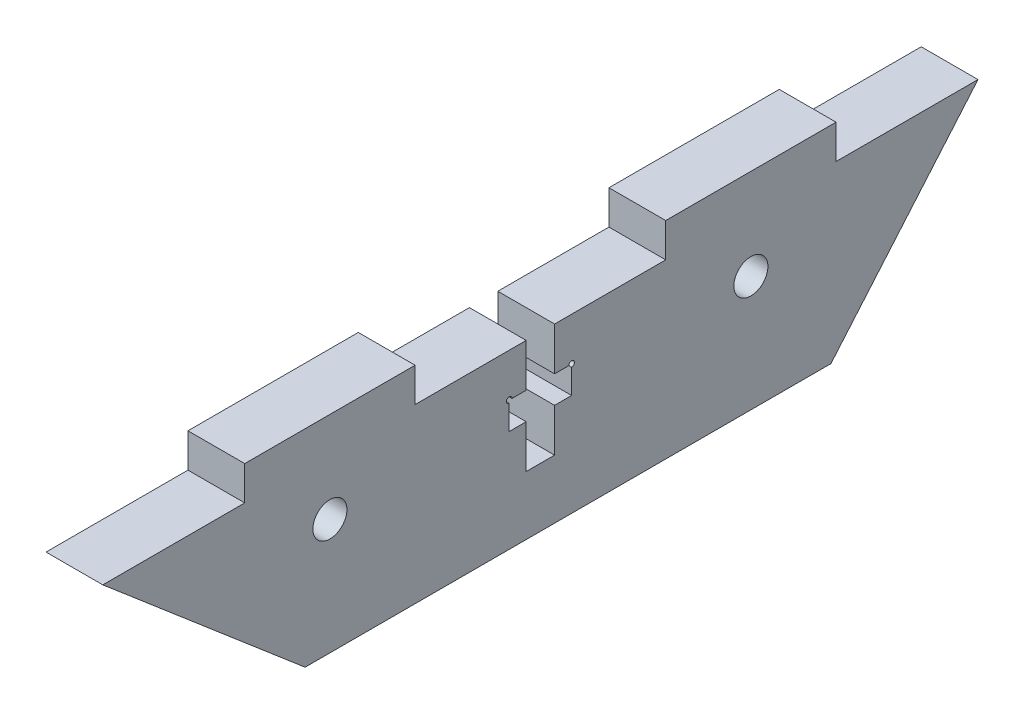
ISO-10303-21;
HEADER;
FILE_DESCRIPTION(('STEP AP214'),'2;1');
FILE_NAME('part.step','',(''),(''),'','','');
FILE_SCHEMA(('AUTOMOTIVE_DESIGN { 1 0 10303 214 1 1 1 1 }'));
ENDSEC;
DATA;
#1=APPLICATION_CONTEXT('core data for automotive mechanical design processes');
#2=APPLICATION_PROTOCOL_DEFINITION('international standard','automotive_design',2000,#1);
#3=PRODUCT_CONTEXT('',#1,'mechanical');
#4=PRODUCT('Part','Part','',(#3));
#5=PRODUCT_RELATED_PRODUCT_CATEGORY('part','',(#4));
#6=PRODUCT_DEFINITION_FORMATION('','',#4);
#7=PRODUCT_DEFINITION_CONTEXT('part definition',#1,'design');
#8=PRODUCT_DEFINITION('design','',#6,#7);
#9=PRODUCT_DEFINITION_SHAPE('','',#8);
#10=(LENGTH_UNIT() NAMED_UNIT(*) SI_UNIT(.MILLI.,.METRE.));
#11=(NAMED_UNIT(*) PLANE_ANGLE_UNIT() SI_UNIT($,.RADIAN.));
#12=(NAMED_UNIT(*) SI_UNIT($,.STERADIAN.) SOLID_ANGLE_UNIT());
#13=UNCERTAINTY_MEASURE_WITH_UNIT(LENGTH_MEASURE(1.E-05),#10,'distance_accuracy_value','');
#14=(GEOMETRIC_REPRESENTATION_CONTEXT(3) GLOBAL_UNCERTAINTY_ASSIGNED_CONTEXT((#13)) GLOBAL_UNIT_ASSIGNED_CONTEXT((#10,
#11,#12)) REPRESENTATION_CONTEXT('',''));
#15=CARTESIAN_POINT('',(0.,0.,0.));
#16=DIRECTION('',(0.,0.,1.));
#17=DIRECTION('',(1.,0.,0.));
#18=AXIS2_PLACEMENT_3D('',#15,#16,#17);
#19=CARTESIAN_POINT('',(5.,7.595,38.535));
#20=DIRECTION('',(0.,-1.,0.));
#21=DIRECTION('',(0.,0.,-1.));
#22=AXIS2_PLACEMENT_3D('',#19,#20,#21);
#23=PLANE('',#22);
#24=DIRECTION('',(-1.,0.,0.));
#25=VECTOR('',#24,1.);
#26=CARTESIAN_POINT('',(5.00005,7.595,-1.24999999999999));
#27=LINE('',#26,#25);
#28=CARTESIAN_POINT('',(5.,7.595,-1.24999999999999));
#29=VERTEX_POINT('',#28);
#30=CARTESIAN_POINT('',(0.,7.595,-1.24999999999999));
#31=VERTEX_POINT('',#30);
#32=EDGE_CURVE('E363',#29,#31,#27,.T.);
#33=ORIENTED_EDGE('',*,*,#32,.F.);
#34=DIRECTION('',(0.,0.,1.));
#35=VECTOR('',#34,1.);
#36=CARTESIAN_POINT('',(5.,7.595,38.535));
#37=LINE('',#36,#35);
#38=CARTESIAN_POINT('',(5.,7.595,-11.035));
#39=VERTEX_POINT('',#38);
#40=EDGE_CURVE('E287',#39,#29,#37,.T.);
#41=ORIENTED_EDGE('',*,*,#40,.F.);
#42=DIRECTION('',(1.,0.,0.));
#43=VECTOR('',#42,1.);
#44=CARTESIAN_POINT('',(0.,7.595,-11.035));
#45=LINE('',#44,#43);
#46=CARTESIAN_POINT('',(0.,7.595,-11.035));
#47=VERTEX_POINT('',#46);
#48=EDGE_CURVE('E267',#47,#39,#45,.T.);
#49=ORIENTED_EDGE('',*,*,#48,.F.);
#50=DIRECTION('',(0.,0.,1.));
#51=VECTOR('',#50,1.);
#52=CARTESIAN_POINT('',(0.,7.595,38.535));
#53=LINE('',#52,#51);
#54=EDGE_CURVE('E327',#47,#31,#53,.T.);
#55=ORIENTED_EDGE('',*,*,#54,.T.);
#56=EDGE_LOOP('',(#33,#41,#49,#55));
#57=FACE_BOUND('',#56,.T.);
#58=ADVANCED_FACE('F35',(#57),#23,.F.);
#59=DIRECTION('',(-1.,0.,0.));
#60=VECTOR('',#59,1.);
#61=CARTESIAN_POINT('',(5.00005,7.595,1.24999999999999));
#62=LINE('',#61,#60);
#63=CARTESIAN_POINT('',(5.,7.595,1.24999999999999));
#64=VERTEX_POINT('',#63);
#65=CARTESIAN_POINT('',(0.,7.595,1.24999999999999));
#66=VERTEX_POINT('',#65);
#67=EDGE_CURVE('E404',#64,#66,#62,.T.);
#68=ORIENTED_EDGE('',*,*,#67,.T.);
#69=CARTESIAN_POINT('',(0.,7.595,11.035));
#70=VERTEX_POINT('',#69);
#71=EDGE_CURVE('E315',#66,#70,#53,.T.);
#72=ORIENTED_EDGE('',*,*,#71,.T.);
#73=DIRECTION('',(-1.,0.,0.));
#74=VECTOR('',#73,1.);
#75=CARTESIAN_POINT('',(0.,7.595,11.035));
#76=LINE('',#75,#74);
#77=CARTESIAN_POINT('',(5.,7.595,11.035));
#78=VERTEX_POINT('',#77);
#79=EDGE_CURVE('E245',#78,#70,#76,.T.);
#80=ORIENTED_EDGE('',*,*,#79,.F.);
#81=EDGE_CURVE('E347',#64,#78,#37,.T.);
#82=ORIENTED_EDGE('',*,*,#81,.F.);
#83=EDGE_LOOP('',(#68,#72,#80,#82));
#84=FACE_BOUND('',#83,.T.);
#85=ADVANCED_FACE('F392',(#84),#23,.F.);
#86=CARTESIAN_POINT('',(5.,0.,0.));
#87=DIRECTION('',(1.,0.,0.));
#88=DIRECTION('',(0.,0.,-1.));
#89=AXIS2_PLACEMENT_3D('',#86,#87,#88);
#90=PLANE('',#89);
#91=CARTESIAN_POINT('',(5.,3.79500000000001,-2.75));
#92=DIRECTION('',(1.,0.,0.));
#93=DIRECTION('',(0.,0.,-1.));
#94=AXIS2_PLACEMENT_3D('',#91,#92,#93);
#95=CIRCLE('',#94,0.25);
#96=CARTESIAN_POINT('',(5.,3.54500000000001,-2.75));
#97=VERTEX_POINT('',#96);
#98=CARTESIAN_POINT('',(5.,3.79500000000001,-2.5));
#99=VERTEX_POINT('',#98);
#100=EDGE_CURVE('E49',#97,#99,#95,.T.);
#101=ORIENTED_EDGE('',*,*,#100,.F.);
#102=DIRECTION('',(0.,-1.,0.));
#103=VECTOR('',#102,1.);
#104=CARTESIAN_POINT('',(5.,0.,-2.75));
#105=LINE('',#104,#103);
#106=CARTESIAN_POINT('',(5.,1.39500000000001,-2.75));
#107=VERTEX_POINT('',#106);
#108=EDGE_CURVE('E219',#97,#107,#105,.T.);
#109=ORIENTED_EDGE('',*,*,#108,.T.);
#110=DIRECTION('',(0.,0.,1.));
#111=VECTOR('',#110,1.);
#112=CARTESIAN_POINT('',(5.,1.395,0.));
#113=LINE('',#112,#111);
#114=CARTESIAN_POINT('',(5.,1.395,-1.24999999999999));
#115=VERTEX_POINT('',#114);
#116=EDGE_CURVE('E227',#107,#115,#113,.T.);
#117=ORIENTED_EDGE('',*,*,#116,.T.);
#118=DIRECTION('',(0.,-1.,0.));
#119=VECTOR('',#118,1.);
#120=CARTESIAN_POINT('',(5.,0.,-1.24999999999999));
#121=LINE('',#120,#119);
#122=CARTESIAN_POINT('',(5.,-2.405,-1.24999999999999));
#123=VERTEX_POINT('',#122);
#124=EDGE_CURVE('E229',#115,#123,#121,.T.);
#125=ORIENTED_EDGE('',*,*,#124,.T.);
#126=DIRECTION('',(0.,0.,1.));
#127=VECTOR('',#126,1.);
#128=CARTESIAN_POINT('',(5.,-2.405,0.));
#129=LINE('',#128,#127);
#130=CARTESIAN_POINT('',(5.,-2.405,1.24999999999999));
#131=VERTEX_POINT('',#130);
#132=EDGE_CURVE('E237',#123,#131,#129,.T.);
#133=ORIENTED_EDGE('',*,*,#132,.T.);
#134=DIRECTION('',(0.,1.,0.));
#135=VECTOR('',#134,1.);
#136=CARTESIAN_POINT('',(5.,0.,1.24999999999999));
#137=LINE('',#136,#135);
#138=CARTESIAN_POINT('',(5.,1.395,1.24999999999999));
#139=VERTEX_POINT('',#138);
#140=EDGE_CURVE('E433',#131,#139,#137,.T.);
#141=ORIENTED_EDGE('',*,*,#140,.T.);
#142=DIRECTION('',(0.,0.,1.));
#143=VECTOR('',#142,1.);
#144=CARTESIAN_POINT('',(5.,1.395,0.));
#145=LINE('',#144,#143);
#146=CARTESIAN_POINT('',(5.,1.39499999999999,2.75));
#147=VERTEX_POINT('',#146);
#148=EDGE_CURVE('E430',#139,#147,#145,.T.);
#149=ORIENTED_EDGE('',*,*,#148,.T.);
#150=DIRECTION('',(0.,1.,0.));
#151=VECTOR('',#150,1.);
#152=CARTESIAN_POINT('',(5.,0.,2.75));
#153=LINE('',#152,#151);
#154=CARTESIAN_POINT('',(5.,3.54499999999999,2.75));
#155=VERTEX_POINT('',#154);
#156=EDGE_CURVE('E425',#147,#155,#153,.T.);
#157=ORIENTED_EDGE('',*,*,#156,.T.);
#158=CARTESIAN_POINT('',(5.,3.79499999999999,2.75));
#159=DIRECTION('',(1.,0.,0.));
#160=DIRECTION('',(0.,0.,-1.));
#161=AXIS2_PLACEMENT_3D('',#158,#159,#160);
#162=CIRCLE('',#161,0.25);
#163=CARTESIAN_POINT('',(5.,3.79499999999999,2.5));
#164=VERTEX_POINT('',#163);
#165=EDGE_CURVE('E57',#164,#155,#162,.T.);
#166=ORIENTED_EDGE('',*,*,#165,.F.);
#167=DIRECTION('',(0.,0.,-1.));
#168=VECTOR('',#167,1.);
#169=CARTESIAN_POINT('',(5.,3.795,0.));
#170=LINE('',#169,#168);
#171=CARTESIAN_POINT('',(5.,3.795,1.24999999999999));
#172=VERTEX_POINT('',#171);
#173=EDGE_CURVE('E422',#164,#172,#170,.T.);
#174=ORIENTED_EDGE('',*,*,#173,.T.);
#175=DIRECTION('',(0.,1.,0.));
#176=VECTOR('',#175,1.);
#177=CARTESIAN_POINT('',(5.,0.,1.24999999999999));
#178=LINE('',#177,#176);
#179=EDGE_CURVE('E420',#172,#64,#178,.T.);
#180=ORIENTED_EDGE('',*,*,#179,.T.);
#181=ORIENTED_EDGE('',*,*,#81,.T.);
#182=DIRECTION('',(0.,-1.,0.));
#183=VECTOR('',#182,1.);
#184=CARTESIAN_POINT('',(5.00000000000003,10.595,11.035));
#185=LINE('',#184,#183);
#186=CARTESIAN_POINT('',(5.00000000000003,10.595,11.035));
#187=VERTEX_POINT('',#186);
#188=EDGE_CURVE('E261',#187,#78,#185,.T.);
#189=ORIENTED_EDGE('',*,*,#188,.F.);
#190=DIRECTION('',(0.,0.,-1.));
#191=VECTOR('',#190,1.);
#192=CARTESIAN_POINT('',(5.00000000000007,10.595,26.035));
#193=LINE('',#192,#191);
#194=CARTESIAN_POINT('',(5.00000000000007,10.595,26.035));
#195=VERTEX_POINT('',#194);
#196=EDGE_CURVE('E244',#195,#187,#193,.T.);
#197=ORIENTED_EDGE('',*,*,#196,.F.);
#198=DIRECTION('',(0.,-1.,0.));
#199=VECTOR('',#198,1.);
#200=CARTESIAN_POINT('',(5.00000000000007,10.595,26.035));
#201=LINE('',#200,#199);
#202=CARTESIAN_POINT('',(5.,7.595,26.035));
#203=VERTEX_POINT('',#202);
#204=EDGE_CURVE('E264',#195,#203,#201,.T.);
#205=ORIENTED_EDGE('',*,*,#204,.T.);
#206=CARTESIAN_POINT('',(5.,7.595,38.535));
#207=VERTEX_POINT('',#206);
#208=EDGE_CURVE('E317',#203,#207,#37,.T.);
#209=ORIENTED_EDGE('',*,*,#208,.T.);
#210=DIRECTION('',(0.,0.648784221735362,0.760972426325186));
#211=VECTOR('',#210,1.);
#212=CARTESIAN_POINT('',(5.,-7.595,20.7183349692734));
#213=LINE('',#212,#211);
#214=CARTESIAN_POINT('',(5.,-7.595,20.7183349692734));
#215=VERTEX_POINT('',#214);
#216=EDGE_CURVE('E567',#215,#207,#213,.T.);
#217=ORIENTED_EDGE('',*,*,#216,.F.);
#218=DIRECTION('',(0.,0.,-1.));
#219=VECTOR('',#218,1.);
#220=CARTESIAN_POINT('',(5.,-7.595,38.535));
#221=LINE('',#220,#219);
#222=CARTESIAN_POINT('',(5.,-7.595,-25.5844225713919));
#223=VERTEX_POINT('',#222);
#224=EDGE_CURVE('E331',#215,#223,#221,.T.);
#225=ORIENTED_EDGE('',*,*,#224,.T.);
#226=DIRECTION('',(0.,-0.760972426325188,0.648784221735359));
#227=VECTOR('',#226,1.);
#228=CARTESIAN_POINT('',(5.,7.595,-38.535));
#229=LINE('',#228,#227);
#230=CARTESIAN_POINT('',(5.,7.595,-38.535));
#231=VERTEX_POINT('',#230);
#232=EDGE_CURVE('E574',#231,#223,#229,.T.);
#233=ORIENTED_EDGE('',*,*,#232,.F.);
#234=CARTESIAN_POINT('',(5.,7.595,-26.035));
#235=VERTEX_POINT('',#234);
#236=EDGE_CURVE('E338',#231,#235,#37,.T.);
#237=ORIENTED_EDGE('',*,*,#236,.T.);
#238=DIRECTION('',(0.,-1.,0.));
#239=VECTOR('',#238,1.);
#240=CARTESIAN_POINT('',(5.,10.595,-26.035));
#241=LINE('',#240,#239);
#242=CARTESIAN_POINT('',(5.,10.595,-26.035));
#243=VERTEX_POINT('',#242);
#244=EDGE_CURVE('E294',#243,#235,#241,.T.);
#245=ORIENTED_EDGE('',*,*,#244,.F.);
#246=DIRECTION('',(0.,0.,-1.));
#247=VECTOR('',#246,1.);
#248=CARTESIAN_POINT('',(5.,10.595,-26.035));
#249=LINE('',#248,#247);
#250=CARTESIAN_POINT('',(5.,10.595,-11.035));
#251=VERTEX_POINT('',#250);
#252=EDGE_CURVE('E274',#251,#243,#249,.T.);
#253=ORIENTED_EDGE('',*,*,#252,.F.);
#254=DIRECTION('',(0.,-1.,0.));
#255=VECTOR('',#254,1.);
#256=CARTESIAN_POINT('',(5.,10.595,-11.035));
#257=LINE('',#256,#255);
#258=EDGE_CURVE('E290',#251,#39,#257,.T.);
#259=ORIENTED_EDGE('',*,*,#258,.T.);
#260=ORIENTED_EDGE('',*,*,#40,.T.);
#261=DIRECTION('',(0.,-1.,0.));
#262=VECTOR('',#261,1.);
#263=CARTESIAN_POINT('',(5.,0.,-1.24999999999999));
#264=LINE('',#263,#262);
#265=CARTESIAN_POINT('',(5.,3.795,-1.24999999999999));
#266=VERTEX_POINT('',#265);
#267=EDGE_CURVE('E231',#29,#266,#264,.T.);
#268=ORIENTED_EDGE('',*,*,#267,.T.);
#269=DIRECTION('',(0.,0.,-1.));
#270=VECTOR('',#269,1.);
#271=CARTESIAN_POINT('',(5.,3.795,0.));
#272=LINE('',#271,#270);
#273=EDGE_CURVE('E222',#266,#99,#272,.T.);
#274=ORIENTED_EDGE('',*,*,#273,.T.);
#275=EDGE_LOOP('',(#101,#109,#117,#125,#133,#141,#149,#157,#166,#174,#180,#181,#189,#197,#205,
#209,#217,#225,#233,#237,#245,#253,#259,#260,#268,#274));
#276=FACE_BOUND('',#275,.T.);
#277=CARTESIAN_POINT('',(5.,2.595,-18.535));
#278=DIRECTION('',(1.,0.,0.));
#279=DIRECTION('',(0.,0.,-1.));
#280=AXIS2_PLACEMENT_3D('',#277,#278,#279);
#281=CIRCLE('',#280,1.5);
#282=CARTESIAN_POINT('',(5.,2.595,-20.035));
#283=VERTEX_POINT('',#282);
#284=EDGE_CURVE('E558',#283,#283,#281,.T.);
#285=ORIENTED_EDGE('',*,*,#284,.F.);
#286=EDGE_LOOP('',(#285));
#287=FACE_BOUND('',#286,.T.);
#288=CARTESIAN_POINT('',(5.,2.595,18.535));
#289=DIRECTION('',(1.,0.,0.));
#290=DIRECTION('',(0.,0.,-1.));
#291=AXIS2_PLACEMENT_3D('',#288,#289,#290);
#292=CIRCLE('',#291,1.5);
#293=CARTESIAN_POINT('',(5.,2.595,17.035));
#294=VERTEX_POINT('',#293);
#295=EDGE_CURVE('E562',#294,#294,#292,.T.);
#296=ORIENTED_EDGE('',*,*,#295,.F.);
#297=EDGE_LOOP('',(#296));
#298=FACE_BOUND('',#297,.T.);
#299=ADVANCED_FACE('F216',(#276,#287,#298),#90,.T.);
#300=CARTESIAN_POINT('',(0.,0.,0.));
#301=DIRECTION('',(1.,0.,0.));
#302=DIRECTION('',(0.,0.,-1.));
#303=AXIS2_PLACEMENT_3D('',#300,#301,#302);
#304=PLANE('',#303);
#305=CARTESIAN_POINT('',(0.,2.595,18.535));
#306=DIRECTION('',(1.,0.,0.));
#307=DIRECTION('',(0.,0.,-1.));
#308=AXIS2_PLACEMENT_3D('',#305,#306,#307);
#309=CIRCLE('',#308,1.5);
#310=CARTESIAN_POINT('',(0.,2.595,17.035));
#311=VERTEX_POINT('',#310);
#312=EDGE_CURVE('E554',#311,#311,#309,.T.);
#313=ORIENTED_EDGE('',*,*,#312,.T.);
#314=EDGE_LOOP('',(#313));
#315=FACE_BOUND('',#314,.T.);
#316=CARTESIAN_POINT('',(0.,2.595,-18.535));
#317=DIRECTION('',(1.,0.,0.));
#318=DIRECTION('',(0.,0.,-1.));
#319=AXIS2_PLACEMENT_3D('',#316,#317,#318);
#320=CIRCLE('',#319,1.5);
#321=CARTESIAN_POINT('',(0.,2.595,-20.035));
#322=VERTEX_POINT('',#321);
#323=EDGE_CURVE('E299',#322,#322,#320,.T.);
#324=ORIENTED_EDGE('',*,*,#323,.T.);
#325=EDGE_LOOP('',(#324));
#326=FACE_BOUND('',#325,.T.);
#327=DIRECTION('',(0.,1.,0.));
#328=VECTOR('',#327,1.);
#329=CARTESIAN_POINT('',(0.,3.79500000000001,-2.75));
#330=LINE('',#329,#328);
#331=CARTESIAN_POINT('',(0.,1.39500000000001,-2.75));
#332=VERTEX_POINT('',#331);
#333=CARTESIAN_POINT('',(0.,3.54500000000001,-2.75));
#334=VERTEX_POINT('',#333);
#335=EDGE_CURVE('E468',#332,#334,#330,.T.);
#336=ORIENTED_EDGE('',*,*,#335,.T.);
#337=CARTESIAN_POINT('',(0.,3.79500000000001,-2.75));
#338=DIRECTION('',(1.,0.,0.));
#339=DIRECTION('',(0.,0.,-1.));
#340=AXIS2_PLACEMENT_3D('',#337,#338,#339);
#341=CIRCLE('',#340,0.25);
#342=CARTESIAN_POINT('',(0.,3.79500000000001,-2.5));
#343=VERTEX_POINT('',#342);
#344=EDGE_CURVE('E208',#334,#343,#341,.T.);
#345=ORIENTED_EDGE('',*,*,#344,.T.);
#346=DIRECTION('',(0.,0.,1.));
#347=VECTOR('',#346,1.);
#348=CARTESIAN_POINT('',(0.,3.795,-1.24999999999999));
#349=LINE('',#348,#347);
#350=CARTESIAN_POINT('',(0.,3.795,-1.24999999999999));
#351=VERTEX_POINT('',#350);
#352=EDGE_CURVE('E466',#343,#351,#349,.T.);
#353=ORIENTED_EDGE('',*,*,#352,.T.);
#354=DIRECTION('',(0.,1.,0.));
#355=VECTOR('',#354,1.);
#356=CARTESIAN_POINT('',(0.,7.595,-1.24999999999999));
#357=LINE('',#356,#355);
#358=EDGE_CURVE('E370',#351,#31,#357,.T.);
#359=ORIENTED_EDGE('',*,*,#358,.T.);
#360=ORIENTED_EDGE('',*,*,#54,.F.);
#361=DIRECTION('',(0.,-1.,0.));
#362=VECTOR('',#361,1.);
#363=CARTESIAN_POINT('',(0.,10.595,-11.035));
#364=LINE('',#363,#362);
#365=CARTESIAN_POINT('',(0.,10.595,-11.035));
#366=VERTEX_POINT('',#365);
#367=EDGE_CURVE('E293',#366,#47,#364,.T.);
#368=ORIENTED_EDGE('',*,*,#367,.F.);
#369=DIRECTION('',(0.,0.,1.));
#370=VECTOR('',#369,1.);
#371=CARTESIAN_POINT('',(0.,10.595,-26.035));
#372=LINE('',#371,#370);
#373=CARTESIAN_POINT('',(0.,10.595,-26.035));
#374=VERTEX_POINT('',#373);
#375=EDGE_CURVE('E268',#374,#366,#372,.T.);
#376=ORIENTED_EDGE('',*,*,#375,.F.);
#377=DIRECTION('',(0.,-1.,0.));
#378=VECTOR('',#377,1.);
#379=CARTESIAN_POINT('',(0.,10.595,-26.035));
#380=LINE('',#379,#378);
#381=CARTESIAN_POINT('',(0.,7.595,-26.035));
#382=VERTEX_POINT('',#381);
#383=EDGE_CURVE('E278',#374,#382,#380,.T.);
#384=ORIENTED_EDGE('',*,*,#383,.T.);
#385=CARTESIAN_POINT('',(0.,7.595,-38.535));
#386=VERTEX_POINT('',#385);
#387=EDGE_CURVE('E330',#386,#382,#53,.T.);
#388=ORIENTED_EDGE('',*,*,#387,.F.);
#389=DIRECTION('',(0.,-0.760972426325188,0.648784221735359));
#390=VECTOR('',#389,1.);
#391=CARTESIAN_POINT('',(0.,7.595,-38.535));
#392=LINE('',#391,#390);
#393=CARTESIAN_POINT('',(0.,-7.595,-25.5844225713919));
#394=VERTEX_POINT('',#393);
#395=EDGE_CURVE('E573',#386,#394,#392,.T.);
#396=ORIENTED_EDGE('',*,*,#395,.T.);
#397=DIRECTION('',(0.,0.,-1.));
#398=VECTOR('',#397,1.);
#399=CARTESIAN_POINT('',(0.,-7.595,38.535));
#400=LINE('',#399,#398);
#401=CARTESIAN_POINT('',(0.,-7.595,20.7183349692734));
#402=VERTEX_POINT('',#401);
#403=EDGE_CURVE('E316',#402,#394,#400,.T.);
#404=ORIENTED_EDGE('',*,*,#403,.F.);
#405=DIRECTION('',(0.,0.648784221735362,0.760972426325186));
#406=VECTOR('',#405,1.);
#407=CARTESIAN_POINT('',(0.,-7.595,20.7183349692734));
#408=LINE('',#407,#406);
#409=CARTESIAN_POINT('',(0.,7.595,38.535));
#410=VERTEX_POINT('',#409);
#411=EDGE_CURVE('E565',#402,#410,#408,.T.);
#412=ORIENTED_EDGE('',*,*,#411,.T.);
#413=CARTESIAN_POINT('',(0.,7.595,26.035));
#414=VERTEX_POINT('',#413);
#415=EDGE_CURVE('E312',#414,#410,#53,.T.);
#416=ORIENTED_EDGE('',*,*,#415,.F.);
#417=DIRECTION('',(0.,-1.,0.));
#418=VECTOR('',#417,1.);
#419=CARTESIAN_POINT('',(0.,10.595,26.035));
#420=LINE('',#419,#418);
#421=CARTESIAN_POINT('',(0.,10.595,26.035));
#422=VERTEX_POINT('',#421);
#423=EDGE_CURVE('E251',#422,#414,#420,.T.);
#424=ORIENTED_EDGE('',*,*,#423,.F.);
#425=DIRECTION('',(0.,0.,1.));
#426=VECTOR('',#425,1.);
#427=CARTESIAN_POINT('',(0.,10.595,26.035));
#428=LINE('',#427,#426);
#429=CARTESIAN_POINT('',(0.,10.595,11.035));
#430=VERTEX_POINT('',#429);
#431=EDGE_CURVE('E249',#430,#422,#428,.T.);
#432=ORIENTED_EDGE('',*,*,#431,.F.);
#433=DIRECTION('',(0.,-1.,0.));
#434=VECTOR('',#433,1.);
#435=CARTESIAN_POINT('',(0.,10.595,11.035));
#436=LINE('',#435,#434);
#437=EDGE_CURVE('E258',#430,#70,#436,.T.);
#438=ORIENTED_EDGE('',*,*,#437,.T.);
#439=ORIENTED_EDGE('',*,*,#71,.F.);
#440=DIRECTION('',(0.,-1.,0.));
#441=VECTOR('',#440,1.);
#442=CARTESIAN_POINT('',(0.,3.795,1.24999999999999));
#443=LINE('',#442,#441);
#444=CARTESIAN_POINT('',(0.,3.795,1.24999999999999));
#445=VERTEX_POINT('',#444);
#446=EDGE_CURVE('E412',#66,#445,#443,.T.);
#447=ORIENTED_EDGE('',*,*,#446,.T.);
#448=DIRECTION('',(0.,0.,1.));
#449=VECTOR('',#448,1.);
#450=CARTESIAN_POINT('',(0.,3.79499999999999,2.75));
#451=LINE('',#450,#449);
#452=CARTESIAN_POINT('',(0.,3.79499999999999,2.5));
#453=VERTEX_POINT('',#452);
#454=EDGE_CURVE('E462',#445,#453,#451,.T.);
#455=ORIENTED_EDGE('',*,*,#454,.T.);
#456=CARTESIAN_POINT('',(0.,3.79499999999999,2.75));
#457=DIRECTION('',(1.,0.,0.));
#458=DIRECTION('',(0.,0.,-1.));
#459=AXIS2_PLACEMENT_3D('',#456,#457,#458);
#460=CIRCLE('',#459,0.25);
#461=CARTESIAN_POINT('',(0.,3.54499999999999,2.75));
#462=VERTEX_POINT('',#461);
#463=EDGE_CURVE('E481',#453,#462,#460,.T.);
#464=ORIENTED_EDGE('',*,*,#463,.T.);
#465=DIRECTION('',(0.,-1.,0.));
#466=VECTOR('',#465,1.);
#467=CARTESIAN_POINT('',(0.,1.39499999999999,2.75));
#468=LINE('',#467,#466);
#469=CARTESIAN_POINT('',(0.,1.39499999999999,2.75));
#470=VERTEX_POINT('',#469);
#471=EDGE_CURVE('E460',#462,#470,#468,.T.);
#472=ORIENTED_EDGE('',*,*,#471,.T.);
#473=DIRECTION('',(0.,0.,-1.));
#474=VECTOR('',#473,1.);
#475=CARTESIAN_POINT('',(0.,1.395,1.24999999999999));
#476=LINE('',#475,#474);
#477=CARTESIAN_POINT('',(0.,1.395,1.24999999999999));
#478=VERTEX_POINT('',#477);
#479=EDGE_CURVE('E457',#470,#478,#476,.T.);
#480=ORIENTED_EDGE('',*,*,#479,.T.);
#481=DIRECTION('',(0.,-1.,0.));
#482=VECTOR('',#481,1.);
#483=CARTESIAN_POINT('',(0.,-2.405,1.24999999999999));
#484=LINE('',#483,#482);
#485=CARTESIAN_POINT('',(0.,-2.405,1.24999999999999));
#486=VERTEX_POINT('',#485);
#487=EDGE_CURVE('E454',#478,#486,#484,.T.);
#488=ORIENTED_EDGE('',*,*,#487,.T.);
#489=DIRECTION('',(0.,0.,-1.));
#490=VECTOR('',#489,1.);
#491=CARTESIAN_POINT('',(0.,-2.405,-1.24999999999999));
#492=LINE('',#491,#490);
#493=CARTESIAN_POINT('',(0.,-2.405,-1.24999999999999));
#494=VERTEX_POINT('',#493);
#495=EDGE_CURVE('E476',#486,#494,#492,.T.);
#496=ORIENTED_EDGE('',*,*,#495,.T.);
#497=DIRECTION('',(0.,1.,0.));
#498=VECTOR('',#497,1.);
#499=CARTESIAN_POINT('',(0.,1.395,-1.24999999999999));
#500=LINE('',#499,#498);
#501=CARTESIAN_POINT('',(0.,1.395,-1.24999999999999));
#502=VERTEX_POINT('',#501);
#503=EDGE_CURVE('E473',#494,#502,#500,.T.);
#504=ORIENTED_EDGE('',*,*,#503,.T.);
#505=DIRECTION('',(0.,0.,-1.));
#506=VECTOR('',#505,1.);
#507=CARTESIAN_POINT('',(0.,1.39500000000001,-2.75));
#508=LINE('',#507,#506);
#509=EDGE_CURVE('E470',#502,#332,#508,.T.);
#510=ORIENTED_EDGE('',*,*,#509,.T.);
#511=EDGE_LOOP('',(#336,#345,#353,#359,#360,#368,#376,#384,#388,#396,#404,#412,#416,#424,#432,
#438,#439,#447,#455,#464,#472,#480,#488,#496,#504,#510));
#512=FACE_BOUND('',#511,.T.);
#513=ADVANCED_FACE('F367',(#315,#326,#512),#304,.F.);
#514=DIRECTION('',(1.,0.,0.));
#515=VECTOR('',#514,1.);
#516=CARTESIAN_POINT('',(0.,7.595,26.035));
#517=LINE('',#516,#515);
#518=EDGE_CURVE('E240',#414,#203,#517,.T.);
#519=ORIENTED_EDGE('',*,*,#518,.F.);
#520=ORIENTED_EDGE('',*,*,#415,.T.);
#521=DIRECTION('',(-1.,0.,0.));
#522=VECTOR('',#521,1.);
#523=CARTESIAN_POINT('',(5.,7.595,38.535));
#524=LINE('',#523,#522);
#525=EDGE_CURVE('E322',#207,#410,#524,.T.);
#526=ORIENTED_EDGE('',*,*,#525,.F.);
#527=ORIENTED_EDGE('',*,*,#208,.F.);
#528=EDGE_LOOP('',(#519,#520,#526,#527));
#529=FACE_BOUND('',#528,.T.);
#530=ADVANCED_FACE('F384',(#529),#23,.F.);
#531=DIRECTION('',(-1.,0.,0.));
#532=VECTOR('',#531,1.);
#533=CARTESIAN_POINT('',(0.,7.595,-26.035));
#534=LINE('',#533,#532);
#535=EDGE_CURVE('E272',#235,#382,#534,.T.);
#536=ORIENTED_EDGE('',*,*,#535,.F.);
#537=ORIENTED_EDGE('',*,*,#236,.F.);
#538=DIRECTION('',(-1.,0.,0.));
#539=VECTOR('',#538,1.);
#540=CARTESIAN_POINT('',(5.,7.595,-38.535));
#541=LINE('',#540,#539);
#542=EDGE_CURVE('E332',#231,#386,#541,.T.);
#543=ORIENTED_EDGE('',*,*,#542,.T.);
#544=ORIENTED_EDGE('',*,*,#387,.T.);
#545=EDGE_LOOP('',(#536,#537,#543,#544));
#546=FACE_BOUND('',#545,.T.);
#547=ADVANCED_FACE('F382',(#546),#23,.F.);
#548=CARTESIAN_POINT('',(5.,-7.595,38.535));
#549=DIRECTION('',(0.,1.,0.));
#550=DIRECTION('',(0.,0.,1.));
#551=AXIS2_PLACEMENT_3D('',#548,#549,#550);
#552=PLANE('',#551);
#553=DIRECTION('',(-1.,0.,0.));
#554=VECTOR('',#553,1.);
#555=CARTESIAN_POINT('',(5.,-7.595,20.7183349692734));
#556=LINE('',#555,#554);
#557=EDGE_CURVE('E569',#215,#402,#556,.T.);
#558=ORIENTED_EDGE('',*,*,#557,.T.);
#559=ORIENTED_EDGE('',*,*,#403,.T.);
#560=DIRECTION('',(-1.,0.,0.));
#561=VECTOR('',#560,1.);
#562=CARTESIAN_POINT('',(5.,-7.595,-25.5844225713919));
#563=LINE('',#562,#561);
#564=EDGE_CURVE('E577',#223,#394,#563,.T.);
#565=ORIENTED_EDGE('',*,*,#564,.F.);
#566=ORIENTED_EDGE('',*,*,#224,.F.);
#567=EDGE_LOOP('',(#558,#559,#565,#566));
#568=FACE_BOUND('',#567,.T.);
#569=ADVANCED_FACE('F37',(#568),#552,.F.);
#570=CARTESIAN_POINT('',(5.,7.595,-38.535));
#571=DIRECTION('',(0.,-0.648784221735359,-0.760972426325188));
#572=DIRECTION('',(0.,0.760972426325188,-0.648784221735359));
#573=AXIS2_PLACEMENT_3D('',#570,#571,#572);
#574=PLANE('',#573);
#575=ORIENTED_EDGE('',*,*,#395,.F.);
#576=ORIENTED_EDGE('',*,*,#542,.F.);
#577=ORIENTED_EDGE('',*,*,#232,.T.);
#578=ORIENTED_EDGE('',*,*,#564,.T.);
#579=EDGE_LOOP('',(#575,#576,#577,#578));
#580=FACE_BOUND('',#579,.T.);
#581=ADVANCED_FACE('F389',(#580),#574,.T.);
#582=CARTESIAN_POINT('',(5.,-7.595,20.7183349692734));
#583=DIRECTION('',(0.,-0.760972426325186,0.648784221735362));
#584=DIRECTION('',(0.,-0.648784221735362,-0.760972426325186));
#585=AXIS2_PLACEMENT_3D('',#582,#583,#584);
#586=PLANE('',#585);
#587=ORIENTED_EDGE('',*,*,#411,.F.);
#588=ORIENTED_EDGE('',*,*,#557,.F.);
#589=ORIENTED_EDGE('',*,*,#216,.T.);
#590=ORIENTED_EDGE('',*,*,#525,.T.);
#591=EDGE_LOOP('',(#587,#588,#589,#590));
#592=FACE_BOUND('',#591,.T.);
#593=ADVANCED_FACE('F541',(#592),#586,.T.);
#594=CARTESIAN_POINT('',(5.,2.595,18.535));
#595=DIRECTION('',(-1.,0.,0.));
#596=DIRECTION('',(0.,0.,1.));
#597=AXIS2_PLACEMENT_3D('',#594,#595,#596);
#598=CYLINDRICAL_SURFACE('',#597,1.5);
#599=ORIENTED_EDGE('',*,*,#295,.T.);
#600=EDGE_LOOP('',(#599));
#601=FACE_BOUND('',#600,.T.);
#602=ORIENTED_EDGE('',*,*,#312,.F.);
#603=EDGE_LOOP('',(#602));
#604=FACE_BOUND('',#603,.T.);
#605=ADVANCED_FACE('F537',(#601,#604),#598,.F.);
#606=CARTESIAN_POINT('',(5.,2.595,-18.535));
#607=DIRECTION('',(-1.,0.,0.));
#608=DIRECTION('',(0.,0.,1.));
#609=AXIS2_PLACEMENT_3D('',#606,#607,#608);
#610=CYLINDRICAL_SURFACE('',#609,1.5);
#611=ORIENTED_EDGE('',*,*,#284,.T.);
#612=EDGE_LOOP('',(#611));
#613=FACE_BOUND('',#612,.T.);
#614=ORIENTED_EDGE('',*,*,#323,.F.);
#615=EDGE_LOOP('',(#614));
#616=FACE_BOUND('',#615,.T.);
#617=ADVANCED_FACE('F534',(#613,#616),#610,.F.);
#618=CARTESIAN_POINT('',(0.,10.595,-11.035));
#619=DIRECTION('',(0.,0.,-1.));
#620=DIRECTION('',(-1.,0.,0.));
#621=AXIS2_PLACEMENT_3D('',#618,#619,#620);
#622=PLANE('',#621);
#623=ORIENTED_EDGE('',*,*,#48,.T.);
#624=ORIENTED_EDGE('',*,*,#258,.F.);
#625=DIRECTION('',(1.,0.,0.));
#626=VECTOR('',#625,1.);
#627=CARTESIAN_POINT('',(0.,10.595,-11.035));
#628=LINE('',#627,#626);
#629=EDGE_CURVE('E271',#366,#251,#628,.T.);
#630=ORIENTED_EDGE('',*,*,#629,.F.);
#631=ORIENTED_EDGE('',*,*,#367,.T.);
#632=EDGE_LOOP('',(#623,#624,#630,#631));
#633=FACE_BOUND('',#632,.T.);
#634=ADVANCED_FACE('F372',(#633),#622,.F.);
#635=CARTESIAN_POINT('',(0.,10.595,-26.035));
#636=DIRECTION('',(0.,0.,1.));
#637=DIRECTION('',(1.,0.,0.));
#638=AXIS2_PLACEMENT_3D('',#635,#636,#637);
#639=PLANE('',#638);
#640=ORIENTED_EDGE('',*,*,#535,.T.);
#641=ORIENTED_EDGE('',*,*,#383,.F.);
#642=DIRECTION('',(-1.,0.,0.));
#643=VECTOR('',#642,1.);
#644=CARTESIAN_POINT('',(0.,10.595,-26.035));
#645=LINE('',#644,#643);
#646=EDGE_CURVE('E276',#243,#374,#645,.T.);
#647=ORIENTED_EDGE('',*,*,#646,.F.);
#648=ORIENTED_EDGE('',*,*,#244,.T.);
#649=EDGE_LOOP('',(#640,#641,#647,#648));
#650=FACE_BOUND('',#649,.T.);
#651=ADVANCED_FACE('F381',(#650),#639,.F.);
#652=CARTESIAN_POINT('',(0.,10.595,0.));
#653=DIRECTION('',(0.,1.,0.));
#654=DIRECTION('',(0.,0.,1.));
#655=AXIS2_PLACEMENT_3D('',#652,#653,#654);
#656=PLANE('',#655);
#657=ORIENTED_EDGE('',*,*,#375,.T.);
#658=ORIENTED_EDGE('',*,*,#629,.T.);
#659=ORIENTED_EDGE('',*,*,#252,.T.);
#660=ORIENTED_EDGE('',*,*,#646,.T.);
#661=EDGE_LOOP('',(#657,#658,#659,#660));
#662=FACE_BOUND('',#661,.T.);
#663=ADVANCED_FACE('F376',(#662),#656,.T.);
#664=CARTESIAN_POINT('',(0.,10.595,26.035));
#665=DIRECTION('',(0.,0.,-1.));
#666=DIRECTION('',(-1.,0.,0.));
#667=AXIS2_PLACEMENT_3D('',#664,#665,#666);
#668=PLANE('',#667);
#669=ORIENTED_EDGE('',*,*,#518,.T.);
#670=ORIENTED_EDGE('',*,*,#204,.F.);
#671=DIRECTION('',(1.,0.,0.));
#672=VECTOR('',#671,1.);
#673=CARTESIAN_POINT('',(0.,10.595,26.035));
#674=LINE('',#673,#672);
#675=EDGE_CURVE('E241',#422,#195,#674,.T.);
#676=ORIENTED_EDGE('',*,*,#675,.F.);
#677=ORIENTED_EDGE('',*,*,#423,.T.);
#678=EDGE_LOOP('',(#669,#670,#676,#677));
#679=FACE_BOUND('',#678,.T.);
#680=ADVANCED_FACE('F524',(#679),#668,.F.);
#681=CARTESIAN_POINT('',(0.,10.595,11.035));
#682=DIRECTION('',(0.,0.,1.));
#683=DIRECTION('',(1.,0.,0.));
#684=AXIS2_PLACEMENT_3D('',#681,#682,#683);
#685=PLANE('',#684);
#686=ORIENTED_EDGE('',*,*,#79,.T.);
#687=ORIENTED_EDGE('',*,*,#437,.F.);
#688=DIRECTION('',(-1.,0.,0.));
#689=VECTOR('',#688,1.);
#690=CARTESIAN_POINT('',(0.,10.595,11.035));
#691=LINE('',#690,#689);
#692=EDGE_CURVE('E247',#187,#430,#691,.T.);
#693=ORIENTED_EDGE('',*,*,#692,.F.);
#694=ORIENTED_EDGE('',*,*,#188,.T.);
#695=EDGE_LOOP('',(#686,#687,#693,#694));
#696=FACE_BOUND('',#695,.T.);
#697=ADVANCED_FACE('F418',(#696),#685,.F.);
#698=CARTESIAN_POINT('',(0.,10.595,0.));
#699=DIRECTION('',(0.,1.,0.));
#700=DIRECTION('',(0.,0.,1.));
#701=AXIS2_PLACEMENT_3D('',#698,#699,#700);
#702=PLANE('',#701);
#703=ORIENTED_EDGE('',*,*,#675,.T.);
#704=ORIENTED_EDGE('',*,*,#196,.T.);
#705=ORIENTED_EDGE('',*,*,#692,.T.);
#706=ORIENTED_EDGE('',*,*,#431,.T.);
#707=EDGE_LOOP('',(#703,#704,#705,#706));
#708=FACE_BOUND('',#707,.T.);
#709=ADVANCED_FACE('F517',(#708),#702,.T.);
#710=CARTESIAN_POINT('',(5.00005,-2.405,-1.24999999999999));
#711=DIRECTION('',(0.,1.,0.));
#712=DIRECTION('',(0.,0.,1.));
#713=AXIS2_PLACEMENT_3D('',#710,#711,#712);
#714=PLANE('',#713);
#715=DIRECTION('',(-1.,0.,0.));
#716=VECTOR('',#715,1.);
#717=CARTESIAN_POINT('',(5.00005,-2.405,-1.24999999999999));
#718=LINE('',#717,#716);
#719=EDGE_CURVE('E436',#123,#494,#718,.T.);
#720=ORIENTED_EDGE('',*,*,#719,.T.);
#721=ORIENTED_EDGE('',*,*,#495,.F.);
#722=DIRECTION('',(-1.,0.,0.));
#723=VECTOR('',#722,1.);
#724=CARTESIAN_POINT('',(5.00005,-2.405,1.24999999999999));
#725=LINE('',#724,#723);
#726=EDGE_CURVE('E451',#131,#486,#725,.T.);
#727=ORIENTED_EDGE('',*,*,#726,.F.);
#728=ORIENTED_EDGE('',*,*,#132,.F.);
#729=EDGE_LOOP('',(#720,#721,#727,#728));
#730=FACE_BOUND('',#729,.T.);
#731=ADVANCED_FACE('F513',(#730),#714,.T.);
#732=CARTESIAN_POINT('',(5.00005,1.395,-1.24999999999999));
#733=DIRECTION('',(0.,0.,1.));
#734=DIRECTION('',(1.,0.,0.));
#735=AXIS2_PLACEMENT_3D('',#732,#733,#734);
#736=PLANE('',#735);
#737=DIRECTION('',(-1.,0.,0.));
#738=VECTOR('',#737,1.);
#739=CARTESIAN_POINT('',(5.00005,1.395,-1.24999999999999));
#740=LINE('',#739,#738);
#741=EDGE_CURVE('E438',#115,#502,#740,.T.);
#742=ORIENTED_EDGE('',*,*,#741,.T.);
#743=ORIENTED_EDGE('',*,*,#503,.F.);
#744=ORIENTED_EDGE('',*,*,#719,.F.);
#745=ORIENTED_EDGE('',*,*,#124,.F.);
#746=EDGE_LOOP('',(#742,#743,#744,#745));
#747=FACE_BOUND('',#746,.T.);
#748=ADVANCED_FACE('F509',(#747),#736,.T.);
#749=CARTESIAN_POINT('',(5.00005,1.39500000000001,-2.75));
#750=DIRECTION('',(0.,1.,0.));
#751=DIRECTION('',(0.,0.,1.));
#752=AXIS2_PLACEMENT_3D('',#749,#750,#751);
#753=PLANE('',#752);
#754=DIRECTION('',(-1.,0.,0.));
#755=VECTOR('',#754,1.);
#756=CARTESIAN_POINT('',(5.00005,1.39500000000001,-2.75));
#757=LINE('',#756,#755);
#758=EDGE_CURVE('E226',#107,#332,#757,.T.);
#759=ORIENTED_EDGE('',*,*,#758,.T.);
#760=ORIENTED_EDGE('',*,*,#509,.F.);
#761=ORIENTED_EDGE('',*,*,#741,.F.);
#762=ORIENTED_EDGE('',*,*,#116,.F.);
#763=EDGE_LOOP('',(#759,#760,#761,#762));
#764=FACE_BOUND('',#763,.T.);
#765=ADVANCED_FACE('F506',(#764),#753,.T.);
#766=CARTESIAN_POINT('',(5.00005,3.79500000000001,-2.75));
#767=DIRECTION('',(0.,0.,1.));
#768=DIRECTION('',(1.,0.,0.));
#769=AXIS2_PLACEMENT_3D('',#766,#767,#768);
#770=PLANE('',#769);
#771=DIRECTION('',(1.,0.,0.));
#772=VECTOR('',#771,1.);
#773=CARTESIAN_POINT('',(-5.,3.54500000000001,-2.75));
#774=LINE('',#773,#772);
#775=EDGE_CURVE('E205',#334,#97,#774,.T.);
#776=ORIENTED_EDGE('',*,*,#775,.F.);
#777=ORIENTED_EDGE('',*,*,#335,.F.);
#778=ORIENTED_EDGE('',*,*,#758,.F.);
#779=ORIENTED_EDGE('',*,*,#108,.F.);
#780=EDGE_LOOP('',(#776,#777,#778,#779));
#781=FACE_BOUND('',#780,.T.);
#782=ADVANCED_FACE('F225',(#781),#770,.T.);
#783=CARTESIAN_POINT('',(5.00005,3.795,-1.24999999999999));
#784=DIRECTION('',(0.,-1.,0.));
#785=DIRECTION('',(0.,0.,-1.));
#786=AXIS2_PLACEMENT_3D('',#783,#784,#785);
#787=PLANE('',#786);
#788=DIRECTION('',(1.,0.,0.));
#789=VECTOR('',#788,1.);
#790=CARTESIAN_POINT('',(-5.,3.79500000000001,-2.5));
#791=LINE('',#790,#789);
#792=EDGE_CURVE('E11',#99,#343,#791,.F.);
#793=ORIENTED_EDGE('',*,*,#792,.F.);
#794=ORIENTED_EDGE('',*,*,#273,.F.);
#795=DIRECTION('',(-1.,0.,0.));
#796=VECTOR('',#795,1.);
#797=CARTESIAN_POINT('',(5.00005,3.795,-1.24999999999999));
#798=LINE('',#797,#796);
#799=EDGE_CURVE('E441',#266,#351,#798,.T.);
#800=ORIENTED_EDGE('',*,*,#799,.T.);
#801=ORIENTED_EDGE('',*,*,#352,.F.);
#802=EDGE_LOOP('',(#793,#794,#800,#801));
#803=FACE_BOUND('',#802,.T.);
#804=ADVANCED_FACE('F487',(#803),#787,.T.);
#805=CARTESIAN_POINT('',(5.00005,7.595,-1.24999999999999));
#806=DIRECTION('',(0.,0.,1.));
#807=DIRECTION('',(1.,0.,0.));
#808=AXIS2_PLACEMENT_3D('',#805,#806,#807);
#809=PLANE('',#808);
#810=ORIENTED_EDGE('',*,*,#32,.T.);
#811=ORIENTED_EDGE('',*,*,#358,.F.);
#812=ORIENTED_EDGE('',*,*,#799,.F.);
#813=ORIENTED_EDGE('',*,*,#267,.F.);
#814=EDGE_LOOP('',(#810,#811,#812,#813));
#815=FACE_BOUND('',#814,.T.);
#816=ADVANCED_FACE('F490',(#815),#809,.T.);
#817=CARTESIAN_POINT('',(5.00005,3.795,1.24999999999999));
#818=DIRECTION('',(0.,0.,-1.));
#819=DIRECTION('',(-1.,0.,0.));
#820=AXIS2_PLACEMENT_3D('',#817,#818,#819);
#821=PLANE('',#820);
#822=DIRECTION('',(-1.,0.,0.));
#823=VECTOR('',#822,1.);
#824=CARTESIAN_POINT('',(5.00005,3.795,1.24999999999999));
#825=LINE('',#824,#823);
#826=EDGE_CURVE('E408',#172,#445,#825,.T.);
#827=ORIENTED_EDGE('',*,*,#826,.T.);
#828=ORIENTED_EDGE('',*,*,#446,.F.);
#829=ORIENTED_EDGE('',*,*,#67,.F.);
#830=ORIENTED_EDGE('',*,*,#179,.F.);
#831=EDGE_LOOP('',(#827,#828,#829,#830));
#832=FACE_BOUND('',#831,.T.);
#833=ADVANCED_FACE('F492',(#832),#821,.T.);
#834=CARTESIAN_POINT('',(5.00005,3.79499999999999,2.75));
#835=DIRECTION('',(0.,-1.,0.));
#836=DIRECTION('',(0.,0.,-1.));
#837=AXIS2_PLACEMENT_3D('',#834,#835,#836);
#838=PLANE('',#837);
#839=DIRECTION('',(1.,0.,0.));
#840=VECTOR('',#839,1.);
#841=CARTESIAN_POINT('',(-5.,3.79499999999999,2.5));
#842=LINE('',#841,#840);
#843=EDGE_CURVE('E479',#453,#164,#842,.T.);
#844=ORIENTED_EDGE('',*,*,#843,.F.);
#845=ORIENTED_EDGE('',*,*,#454,.F.);
#846=ORIENTED_EDGE('',*,*,#826,.F.);
#847=ORIENTED_EDGE('',*,*,#173,.F.);
#848=EDGE_LOOP('',(#844,#845,#846,#847));
#849=FACE_BOUND('',#848,.T.);
#850=ADVANCED_FACE('F498',(#849),#838,.T.);
#851=CARTESIAN_POINT('',(5.00005,1.39499999999999,2.75));
#852=DIRECTION('',(0.,0.,-1.));
#853=DIRECTION('',(-1.,0.,0.));
#854=AXIS2_PLACEMENT_3D('',#851,#852,#853);
#855=PLANE('',#854);
#856=DIRECTION('',(1.,0.,0.));
#857=VECTOR('',#856,1.);
#858=CARTESIAN_POINT('',(-5.,3.54499999999999,2.75));
#859=LINE('',#858,#857);
#860=EDGE_CURVE('E43',#155,#462,#859,.F.);
#861=ORIENTED_EDGE('',*,*,#860,.F.);
#862=ORIENTED_EDGE('',*,*,#156,.F.);
#863=DIRECTION('',(-1.,0.,0.));
#864=VECTOR('',#863,1.);
#865=CARTESIAN_POINT('',(5.00005,1.39499999999999,2.75));
#866=LINE('',#865,#864);
#867=EDGE_CURVE('E446',#147,#470,#866,.T.);
#868=ORIENTED_EDGE('',*,*,#867,.T.);
#869=ORIENTED_EDGE('',*,*,#471,.F.);
#870=EDGE_LOOP('',(#861,#862,#868,#869));
#871=FACE_BOUND('',#870,.T.);
#872=ADVANCED_FACE('F605',(#871),#855,.T.);
#873=CARTESIAN_POINT('',(5.00005,1.395,1.24999999999999));
#874=DIRECTION('',(0.,1.,0.));
#875=DIRECTION('',(0.,0.,1.));
#876=AXIS2_PLACEMENT_3D('',#873,#874,#875);
#877=PLANE('',#876);
#878=DIRECTION('',(-1.,0.,0.));
#879=VECTOR('',#878,1.);
#880=CARTESIAN_POINT('',(5.00005,1.395,1.24999999999999));
#881=LINE('',#880,#879);
#882=EDGE_CURVE('E449',#139,#478,#881,.T.);
#883=ORIENTED_EDGE('',*,*,#882,.T.);
#884=ORIENTED_EDGE('',*,*,#479,.F.);
#885=ORIENTED_EDGE('',*,*,#867,.F.);
#886=ORIENTED_EDGE('',*,*,#148,.F.);
#887=EDGE_LOOP('',(#883,#884,#885,#886));
#888=FACE_BOUND('',#887,.T.);
#889=ADVANCED_FACE('F612',(#888),#877,.T.);
#890=CARTESIAN_POINT('',(5.00005,-2.405,1.24999999999999));
#891=DIRECTION('',(0.,0.,-1.));
#892=DIRECTION('',(-1.,0.,0.));
#893=AXIS2_PLACEMENT_3D('',#890,#891,#892);
#894=PLANE('',#893);
#895=ORIENTED_EDGE('',*,*,#726,.T.);
#896=ORIENTED_EDGE('',*,*,#487,.F.);
#897=ORIENTED_EDGE('',*,*,#882,.F.);
#898=ORIENTED_EDGE('',*,*,#140,.F.);
#899=EDGE_LOOP('',(#895,#896,#897,#898));
#900=FACE_BOUND('',#899,.T.);
#901=ADVANCED_FACE('F623',(#900),#894,.T.);
#902=CARTESIAN_POINT('',(-5.,3.79499999999999,2.75));
#903=DIRECTION('',(1.,0.,0.));
#904=DIRECTION('',(0.,0.,-1.));
#905=AXIS2_PLACEMENT_3D('',#902,#903,#904);
#906=CYLINDRICAL_SURFACE('',#905,0.25);
#907=ORIENTED_EDGE('',*,*,#843,.T.);
#908=ORIENTED_EDGE('',*,*,#165,.T.);
#909=ORIENTED_EDGE('',*,*,#860,.T.);
#910=ORIENTED_EDGE('',*,*,#463,.F.);
#911=EDGE_LOOP('',(#907,#908,#909,#910));
#912=FACE_BOUND('',#911,.T.);
#913=ADVANCED_FACE('F618',(#912),#906,.F.);
#914=CARTESIAN_POINT('',(-5.,3.79500000000001,-2.75));
#915=DIRECTION('',(1.,0.,0.));
#916=DIRECTION('',(0.,0.,-1.));
#917=AXIS2_PLACEMENT_3D('',#914,#915,#916);
#918=CYLINDRICAL_SURFACE('',#917,0.25);
#919=ORIENTED_EDGE('',*,*,#775,.T.);
#920=ORIENTED_EDGE('',*,*,#100,.T.);
#921=ORIENTED_EDGE('',*,*,#792,.T.);
#922=ORIENTED_EDGE('',*,*,#344,.F.);
#923=EDGE_LOOP('',(#919,#920,#921,#922));
#924=FACE_BOUND('',#923,.T.);
#925=ADVANCED_FACE('F206',(#924),#918,.F.);
#926=CLOSED_SHELL('',(#58,#85,#299,#513,#530,#547,#569,#581,#593,#605,#617,#634,#651,#663,#680,
#697,#709,#731,#748,#765,#782,#804,#816,#833,#850,#872,#889,#901,#913,#925));
#927=MANIFOLD_SOLID_BREP('B2',#926);
#928=ADVANCED_BREP_SHAPE_REPRESENTATION('',(#18,#927),#14);
#929=SHAPE_DEFINITION_REPRESENTATION(#9,#928);
ENDSEC;
END-ISO-10303-21;
